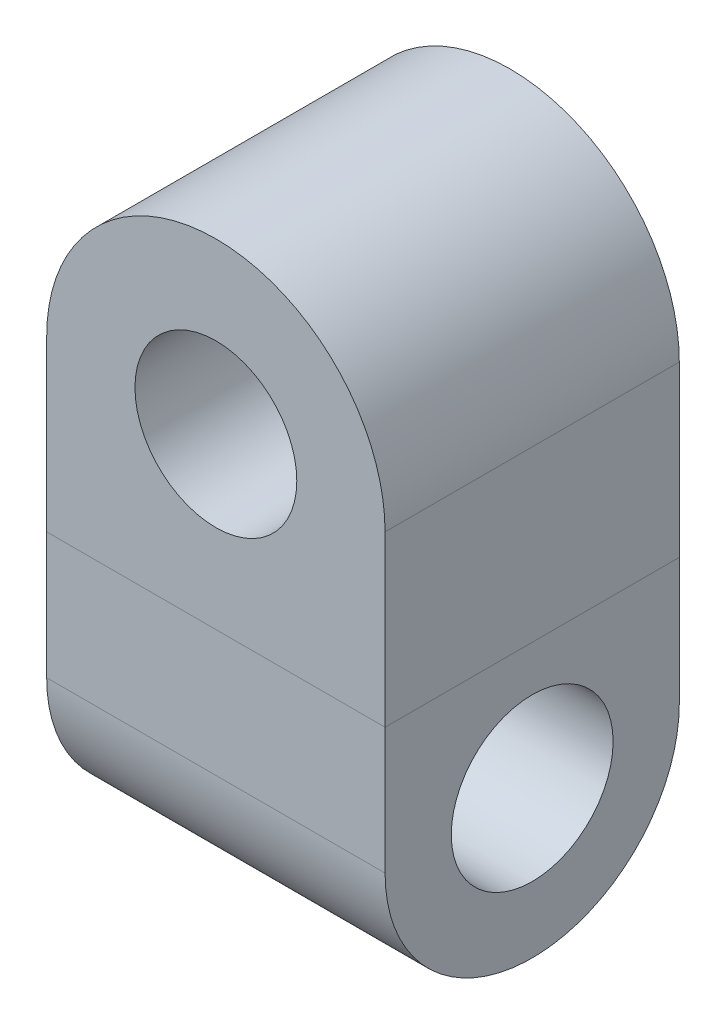
ISO-10303-21;
HEADER;
FILE_DESCRIPTION(('STEP AP214'),'2;1');
FILE_NAME('part.step','',(''),(''),'','','');
FILE_SCHEMA(('AUTOMOTIVE_DESIGN { 1 0 10303 214 1 1 1 1 }'));
ENDSEC;
DATA;
#1=APPLICATION_CONTEXT('core data for automotive mechanical design processes');
#2=APPLICATION_PROTOCOL_DEFINITION('international standard','automotive_design',2000,#1);
#3=PRODUCT_CONTEXT('',#1,'mechanical');
#4=PRODUCT('Part','Part','',(#3));
#5=PRODUCT_RELATED_PRODUCT_CATEGORY('part','',(#4));
#6=PRODUCT_DEFINITION_FORMATION('','',#4);
#7=PRODUCT_DEFINITION_CONTEXT('part definition',#1,'design');
#8=PRODUCT_DEFINITION('design','',#6,#7);
#9=PRODUCT_DEFINITION_SHAPE('','',#8);
#10=(LENGTH_UNIT() NAMED_UNIT(*) SI_UNIT(.MILLI.,.METRE.));
#11=(NAMED_UNIT(*) PLANE_ANGLE_UNIT() SI_UNIT($,.RADIAN.));
#12=(NAMED_UNIT(*) SI_UNIT($,.STERADIAN.) SOLID_ANGLE_UNIT());
#13=UNCERTAINTY_MEASURE_WITH_UNIT(LENGTH_MEASURE(1.E-05),#10,'distance_accuracy_value','');
#14=(GEOMETRIC_REPRESENTATION_CONTEXT(3) GLOBAL_UNCERTAINTY_ASSIGNED_CONTEXT((#13)) GLOBAL_UNIT_ASSIGNED_CONTEXT((#10,
#11,#12)) REPRESENTATION_CONTEXT('',''));
#15=CARTESIAN_POINT('',(0.,0.,0.));
#16=DIRECTION('',(0.,0.,1.));
#17=DIRECTION('',(1.,0.,0.));
#18=AXIS2_PLACEMENT_3D('',#15,#16,#17);
#19=CARTESIAN_POINT('',(-2.921,-5.10183762373373,2.54));
#20=DIRECTION('',(1.,0.,0.));
#21=DIRECTION('',(0.,1.,0.));
#22=AXIS2_PLACEMENT_3D('',#19,#20,#21);
#23=CYLINDRICAL_SURFACE('',#22,2.54);
#24=CARTESIAN_POINT('',(2.921,-5.10183762373373,2.54));
#25=DIRECTION('',(1.,0.,0.));
#26=DIRECTION('',(0.,0.,-1.));
#27=AXIS2_PLACEMENT_3D('',#24,#25,#26);
#28=CIRCLE('',#27,2.54);
#29=CARTESIAN_POINT('',(2.921,-5.10183762373373,5.08));
#30=VERTEX_POINT('',#29);
#31=CARTESIAN_POINT('',(2.921,-5.10183762373373,0.));
#32=VERTEX_POINT('',#31);
#33=EDGE_CURVE('E124',#30,#32,#28,.T.);
#34=ORIENTED_EDGE('',*,*,#33,.F.);
#35=DIRECTION('',(1.,0.,0.));
#36=VECTOR('',#35,1.);
#37=CARTESIAN_POINT('',(-2.921,-5.10183762373373,5.08));
#38=LINE('',#37,#36);
#39=CARTESIAN_POINT('',(-2.921,-5.10183762373373,5.08));
#40=VERTEX_POINT('',#39);
#41=EDGE_CURVE('E13',#40,#30,#38,.T.);
#42=ORIENTED_EDGE('',*,*,#41,.F.);
#43=CARTESIAN_POINT('',(-2.921,-5.10183762373373,2.54));
#44=DIRECTION('',(1.,0.,0.));
#45=DIRECTION('',(0.,0.,-1.));
#46=AXIS2_PLACEMENT_3D('',#43,#44,#45);
#47=CIRCLE('',#46,2.54);
#48=CARTESIAN_POINT('',(-2.921,-5.10183762373373,0.));
#49=VERTEX_POINT('',#48);
#50=EDGE_CURVE('E118',#40,#49,#47,.T.);
#51=ORIENTED_EDGE('',*,*,#50,.T.);
#52=DIRECTION('',(1.,0.,0.));
#53=VECTOR('',#52,1.);
#54=CARTESIAN_POINT('',(-2.921,-5.10183762373373,0.));
#55=LINE('',#54,#53);
#56=EDGE_CURVE('E61',#49,#32,#55,.T.);
#57=ORIENTED_EDGE('',*,*,#56,.T.);
#58=EDGE_LOOP('',(#34,#42,#51,#57));
#59=FACE_BOUND('',#58,.T.);
#60=ADVANCED_FACE('F58',(#59),#23,.T.);
#61=CARTESIAN_POINT('',(-2.921,-5.10183762373373,5.08));
#62=DIRECTION('',(0.,0.,-1.));
#63=DIRECTION('',(-1.,0.,0.));
#64=AXIS2_PLACEMENT_3D('',#61,#62,#63);
#65=PLANE('',#64);
#66=DIRECTION('',(0.,1.,0.));
#67=VECTOR('',#66,1.);
#68=CARTESIAN_POINT('',(2.921,-5.10183762373373,5.08));
#69=LINE('',#68,#67);
#70=CARTESIAN_POINT('',(2.921,-2.921,5.08));
#71=VERTEX_POINT('',#70);
#72=EDGE_CURVE('E91',#30,#71,#69,.T.);
#73=ORIENTED_EDGE('',*,*,#72,.T.);
#74=DIRECTION('',(1.,0.,0.));
#75=VECTOR('',#74,1.);
#76=CARTESIAN_POINT('',(-2.921,-2.921,5.08));
#77=LINE('',#76,#75);
#78=CARTESIAN_POINT('',(-2.921,-2.921,5.08));
#79=VERTEX_POINT('',#78);
#80=EDGE_CURVE('E67',#79,#71,#77,.T.);
#81=ORIENTED_EDGE('',*,*,#80,.F.);
#82=DIRECTION('',(0.,1.,0.));
#83=VECTOR('',#82,1.);
#84=CARTESIAN_POINT('',(-2.921,-5.10183762373373,5.08));
#85=LINE('',#84,#83);
#86=EDGE_CURVE('E108',#40,#79,#85,.T.);
#87=ORIENTED_EDGE('',*,*,#86,.F.);
#88=ORIENTED_EDGE('',*,*,#41,.T.);
#89=EDGE_LOOP('',(#73,#81,#87,#88));
#90=FACE_BOUND('',#89,.T.);
#91=ADVANCED_FACE('F135',(#90),#65,.F.);
#92=CARTESIAN_POINT('',(-2.921,-2.921,5.08));
#93=DIRECTION('',(0.,-1.,0.));
#94=DIRECTION('',(1.,0.,0.));
#95=AXIS2_PLACEMENT_3D('',#92,#93,#94);
#96=PLANE('',#95);
#97=DIRECTION('',(0.,0.,-1.));
#98=VECTOR('',#97,1.);
#99=CARTESIAN_POINT('',(2.921,-2.921,5.08));
#100=LINE('',#99,#98);
#101=CARTESIAN_POINT('',(2.921,-2.921,0.));
#102=VERTEX_POINT('',#101);
#103=EDGE_CURVE('E115',#71,#102,#100,.T.);
#104=ORIENTED_EDGE('',*,*,#103,.T.);
#105=DIRECTION('',(1.,0.,0.));
#106=VECTOR('',#105,1.);
#107=CARTESIAN_POINT('',(-2.921,-2.921,0.));
#108=LINE('',#107,#106);
#109=CARTESIAN_POINT('',(-2.921,-2.921,0.));
#110=VERTEX_POINT('',#109);
#111=EDGE_CURVE('E112',#110,#102,#108,.T.);
#112=ORIENTED_EDGE('',*,*,#111,.F.);
#113=DIRECTION('',(0.,0.,-1.));
#114=VECTOR('',#113,1.);
#115=CARTESIAN_POINT('',(-2.921,-2.921,5.08));
#116=LINE('',#115,#114);
#117=EDGE_CURVE('E103',#79,#110,#116,.T.);
#118=ORIENTED_EDGE('',*,*,#117,.F.);
#119=ORIENTED_EDGE('',*,*,#80,.T.);
#120=EDGE_LOOP('',(#104,#112,#118,#119));
#121=FACE_BOUND('',#120,.T.);
#122=ADVANCED_FACE('F113',(#121),#96,.F.);
#123=CARTESIAN_POINT('',(-2.921,-5.10183762373373,0.));
#124=DIRECTION('',(0.,0.,-1.));
#125=DIRECTION('',(-1.,0.,0.));
#126=AXIS2_PLACEMENT_3D('',#123,#124,#125);
#127=PLANE('',#126);
#128=DIRECTION('',(0.,1.,0.));
#129=VECTOR('',#128,1.);
#130=CARTESIAN_POINT('',(2.921,-5.10183762373373,0.));
#131=LINE('',#130,#129);
#132=EDGE_CURVE('E127',#32,#102,#131,.T.);
#133=ORIENTED_EDGE('',*,*,#132,.F.);
#134=ORIENTED_EDGE('',*,*,#56,.F.);
#135=DIRECTION('',(0.,1.,0.));
#136=VECTOR('',#135,1.);
#137=CARTESIAN_POINT('',(-2.921,-5.10183762373373,0.));
#138=LINE('',#137,#136);
#139=EDGE_CURVE('E107',#49,#110,#138,.T.);
#140=ORIENTED_EDGE('',*,*,#139,.T.);
#141=ORIENTED_EDGE('',*,*,#111,.T.);
#142=EDGE_LOOP('',(#133,#134,#140,#141));
#143=FACE_BOUND('',#142,.T.);
#144=ADVANCED_FACE('F117',(#143),#127,.T.);
#145=CARTESIAN_POINT('',(-2.921,-5.10183762373373,2.54));
#146=DIRECTION('',(1.,0.,0.));
#147=DIRECTION('',(0.,0.,-1.));
#148=AXIS2_PLACEMENT_3D('',#145,#146,#147);
#149=PLANE('',#148);
#150=CARTESIAN_POINT('',(-2.921,-5.10183762373373,2.54));
#151=DIRECTION('',(1.,0.,0.));
#152=DIRECTION('',(0.,0.,-1.));
#153=AXIS2_PLACEMENT_3D('',#150,#151,#152);
#154=CIRCLE('',#153,1.397);
#155=CARTESIAN_POINT('',(-2.921,-5.10183762373373,1.143));
#156=VERTEX_POINT('',#155);
#157=EDGE_CURVE('E128',#156,#156,#154,.T.);
#158=ORIENTED_EDGE('',*,*,#157,.T.);
#159=EDGE_LOOP('',(#158));
#160=FACE_BOUND('',#159,.T.);
#161=ORIENTED_EDGE('',*,*,#50,.F.);
#162=ORIENTED_EDGE('',*,*,#86,.T.);
#163=ORIENTED_EDGE('',*,*,#117,.T.);
#164=ORIENTED_EDGE('',*,*,#139,.F.);
#165=EDGE_LOOP('',(#161,#162,#163,#164));
#166=FACE_BOUND('',#165,.T.);
#167=ADVANCED_FACE('F106',(#160,#166),#149,.F.);
#168=CARTESIAN_POINT('',(2.921,-5.10183762373373,2.54));
#169=DIRECTION('',(1.,0.,0.));
#170=DIRECTION('',(0.,0.,-1.));
#171=AXIS2_PLACEMENT_3D('',#168,#169,#170);
#172=PLANE('',#171);
#173=CARTESIAN_POINT('',(2.921,-5.10183762373373,2.54));
#174=DIRECTION('',(1.,0.,0.));
#175=DIRECTION('',(0.,0.,-1.));
#176=AXIS2_PLACEMENT_3D('',#173,#174,#175);
#177=CIRCLE('',#176,1.397);
#178=CARTESIAN_POINT('',(2.921,-5.10183762373373,1.143));
#179=VERTEX_POINT('',#178);
#180=EDGE_CURVE('E166',#179,#179,#177,.T.);
#181=ORIENTED_EDGE('',*,*,#180,.F.);
#182=EDGE_LOOP('',(#181));
#183=FACE_BOUND('',#182,.T.);
#184=ORIENTED_EDGE('',*,*,#33,.T.);
#185=ORIENTED_EDGE('',*,*,#132,.T.);
#186=ORIENTED_EDGE('',*,*,#103,.F.);
#187=ORIENTED_EDGE('',*,*,#72,.F.);
#188=EDGE_LOOP('',(#184,#185,#186,#187));
#189=FACE_BOUND('',#188,.T.);
#190=ADVANCED_FACE('F133',(#183,#189),#172,.T.);
#191=CARTESIAN_POINT('',(-2.921,-5.10183762373373,2.54));
#192=DIRECTION('',(1.,0.,0.));
#193=DIRECTION('',(0.,1.,0.));
#194=AXIS2_PLACEMENT_3D('',#191,#192,#193);
#195=CYLINDRICAL_SURFACE('',#194,1.397);
#196=ORIENTED_EDGE('',*,*,#157,.F.);
#197=EDGE_LOOP('',(#196));
#198=FACE_BOUND('',#197,.T.);
#199=ORIENTED_EDGE('',*,*,#180,.T.);
#200=EDGE_LOOP('',(#199));
#201=FACE_BOUND('',#200,.T.);
#202=ADVANCED_FACE('F154',(#198,#201),#195,.F.);
#203=CLOSED_SHELL('',(#60,#91,#122,#144,#167,#190,#202));
#204=MANIFOLD_SOLID_BREP('B2',#203);
#205=CARTESIAN_POINT('',(0.,0.,5.08));
#206=DIRECTION('',(0.,0.,1.));
#207=DIRECTION('',(1.,0.,0.));
#208=AXIS2_PLACEMENT_3D('',#205,#206,#207);
#209=PLANE('',#208);
#210=CARTESIAN_POINT('',(0.,0.,5.08));
#211=DIRECTION('',(0.,0.,1.));
#212=DIRECTION('',(1.,0.,0.));
#213=AXIS2_PLACEMENT_3D('',#210,#211,#212);
#214=CIRCLE('',#213,2.921);
#215=CARTESIAN_POINT('',(2.921,0.,5.08));
#216=VERTEX_POINT('',#215);
#217=CARTESIAN_POINT('',(-2.921,0.,5.08));
#218=VERTEX_POINT('',#217);
#219=EDGE_CURVE('E255',#216,#218,#214,.T.);
#220=ORIENTED_EDGE('',*,*,#219,.T.);
#221=DIRECTION('',(0.,-1.,0.));
#222=VECTOR('',#221,1.);
#223=CARTESIAN_POINT('',(-2.921,0.,5.08));
#224=LINE('',#223,#222);
#225=CARTESIAN_POINT('',(-2.921,-2.921,5.08));
#226=VERTEX_POINT('',#225);
#227=EDGE_CURVE('E250',#218,#226,#224,.T.);
#228=ORIENTED_EDGE('',*,*,#227,.T.);
#229=DIRECTION('',(1.,0.,0.));
#230=VECTOR('',#229,1.);
#231=CARTESIAN_POINT('',(2.921,-2.921,5.08));
#232=LINE('',#231,#230);
#233=CARTESIAN_POINT('',(2.921,-2.921,5.08));
#234=VERTEX_POINT('',#233);
#235=EDGE_CURVE('E253',#226,#234,#232,.T.);
#236=ORIENTED_EDGE('',*,*,#235,.T.);
#237=DIRECTION('',(0.,1.,0.));
#238=VECTOR('',#237,1.);
#239=CARTESIAN_POINT('',(2.921,0.,5.08));
#240=LINE('',#239,#238);
#241=EDGE_CURVE('E220',#234,#216,#240,.T.);
#242=ORIENTED_EDGE('',*,*,#241,.T.);
#243=EDGE_LOOP('',(#220,#228,#236,#242));
#244=FACE_BOUND('',#243,.T.);
#245=CARTESIAN_POINT('',(0.,0.,5.08));
#246=DIRECTION('',(0.,0.,1.));
#247=DIRECTION('',(1.,0.,0.));
#248=AXIS2_PLACEMENT_3D('',#245,#246,#247);
#249=CIRCLE('',#248,1.397);
#250=CARTESIAN_POINT('',(1.397,0.,5.08));
#251=VERTEX_POINT('',#250);
#252=EDGE_CURVE('E270',#251,#251,#249,.T.);
#253=ORIENTED_EDGE('',*,*,#252,.F.);
#254=EDGE_LOOP('',(#253));
#255=FACE_BOUND('',#254,.T.);
#256=ADVANCED_FACE('F203',(#244,#255),#209,.T.);
#257=CARTESIAN_POINT('',(0.,0.,0.));
#258=DIRECTION('',(0.,0.,1.));
#259=DIRECTION('',(1.,0.,0.));
#260=AXIS2_PLACEMENT_3D('',#257,#258,#259);
#261=PLANE('',#260);
#262=CARTESIAN_POINT('',(0.,0.,0.));
#263=DIRECTION('',(0.,0.,1.));
#264=DIRECTION('',(1.,0.,0.));
#265=AXIS2_PLACEMENT_3D('',#262,#263,#264);
#266=CIRCLE('',#265,2.921);
#267=CARTESIAN_POINT('',(2.921,0.,0.));
#268=VERTEX_POINT('',#267);
#269=CARTESIAN_POINT('',(-2.921,0.,0.));
#270=VERTEX_POINT('',#269);
#271=EDGE_CURVE('E267',#268,#270,#266,.T.);
#272=ORIENTED_EDGE('',*,*,#271,.F.);
#273=DIRECTION('',(0.,1.,0.));
#274=VECTOR('',#273,1.);
#275=CARTESIAN_POINT('',(2.921,0.,0.));
#276=LINE('',#275,#274);
#277=CARTESIAN_POINT('',(2.921,-2.921,0.));
#278=VERTEX_POINT('',#277);
#279=EDGE_CURVE('E243',#278,#268,#276,.T.);
#280=ORIENTED_EDGE('',*,*,#279,.F.);
#281=DIRECTION('',(1.,0.,0.));
#282=VECTOR('',#281,1.);
#283=CARTESIAN_POINT('',(2.921,-2.921,0.));
#284=LINE('',#283,#282);
#285=CARTESIAN_POINT('',(-2.921,-2.921,0.));
#286=VERTEX_POINT('',#285);
#287=EDGE_CURVE('E237',#286,#278,#284,.T.);
#288=ORIENTED_EDGE('',*,*,#287,.F.);
#289=DIRECTION('',(0.,-1.,0.));
#290=VECTOR('',#289,1.);
#291=CARTESIAN_POINT('',(-2.921,0.,0.));
#292=LINE('',#291,#290);
#293=EDGE_CURVE('E259',#270,#286,#292,.T.);
#294=ORIENTED_EDGE('',*,*,#293,.F.);
#295=EDGE_LOOP('',(#272,#280,#288,#294));
#296=FACE_BOUND('',#295,.T.);
#297=CARTESIAN_POINT('',(0.,0.,0.));
#298=DIRECTION('',(0.,0.,1.));
#299=DIRECTION('',(1.,0.,0.));
#300=AXIS2_PLACEMENT_3D('',#297,#298,#299);
#301=CIRCLE('',#300,1.397);
#302=CARTESIAN_POINT('',(1.397,0.,0.));
#303=VERTEX_POINT('',#302);
#304=EDGE_CURVE('E282',#303,#303,#301,.T.);
#305=ORIENTED_EDGE('',*,*,#304,.T.);
#306=EDGE_LOOP('',(#305));
#307=FACE_BOUND('',#306,.T.);
#308=ADVANCED_FACE('F278',(#296,#307),#261,.F.);
#309=CARTESIAN_POINT('',(0.,0.,5.08));
#310=DIRECTION('',(0.,0.,-1.));
#311=DIRECTION('',(-1.,0.,0.));
#312=AXIS2_PLACEMENT_3D('',#309,#310,#311);
#313=CYLINDRICAL_SURFACE('',#312,2.921);
#314=ORIENTED_EDGE('',*,*,#271,.T.);
#315=DIRECTION('',(0.,0.,-1.));
#316=VECTOR('',#315,1.);
#317=CARTESIAN_POINT('',(-2.921,0.,5.08));
#318=LINE('',#317,#316);
#319=EDGE_CURVE('E56',#218,#270,#318,.T.);
#320=ORIENTED_EDGE('',*,*,#319,.F.);
#321=ORIENTED_EDGE('',*,*,#219,.F.);
#322=DIRECTION('',(0.,0.,-1.));
#323=VECTOR('',#322,1.);
#324=CARTESIAN_POINT('',(2.921,0.,5.08));
#325=LINE('',#324,#323);
#326=EDGE_CURVE('E263',#216,#268,#325,.T.);
#327=ORIENTED_EDGE('',*,*,#326,.T.);
#328=EDGE_LOOP('',(#314,#320,#321,#327));
#329=FACE_BOUND('',#328,.T.);
#330=ADVANCED_FACE('F205',(#329),#313,.T.);
#331=CARTESIAN_POINT('',(-2.921,0.,5.08));
#332=DIRECTION('',(1.,0.,0.));
#333=DIRECTION('',(0.,1.,0.));
#334=AXIS2_PLACEMENT_3D('',#331,#332,#333);
#335=PLANE('',#334);
#336=ORIENTED_EDGE('',*,*,#293,.T.);
#337=DIRECTION('',(0.,0.,-1.));
#338=VECTOR('',#337,1.);
#339=CARTESIAN_POINT('',(-2.921,-2.921,5.08));
#340=LINE('',#339,#338);
#341=EDGE_CURVE('E212',#226,#286,#340,.T.);
#342=ORIENTED_EDGE('',*,*,#341,.F.);
#343=ORIENTED_EDGE('',*,*,#227,.F.);
#344=ORIENTED_EDGE('',*,*,#319,.T.);
#345=EDGE_LOOP('',(#336,#342,#343,#344));
#346=FACE_BOUND('',#345,.T.);
#347=ADVANCED_FACE('F258',(#346),#335,.F.);
#348=CARTESIAN_POINT('',(2.921,-2.921,5.08));
#349=DIRECTION('',(0.,1.,0.));
#350=DIRECTION('',(0.,0.,1.));
#351=AXIS2_PLACEMENT_3D('',#348,#349,#350);
#352=PLANE('',#351);
#353=ORIENTED_EDGE('',*,*,#287,.T.);
#354=DIRECTION('',(0.,0.,-1.));
#355=VECTOR('',#354,1.);
#356=CARTESIAN_POINT('',(2.921,-2.921,5.08));
#357=LINE('',#356,#355);
#358=EDGE_CURVE('E260',#234,#278,#357,.T.);
#359=ORIENTED_EDGE('',*,*,#358,.F.);
#360=ORIENTED_EDGE('',*,*,#235,.F.);
#361=ORIENTED_EDGE('',*,*,#341,.T.);
#362=EDGE_LOOP('',(#353,#359,#360,#361));
#363=FACE_BOUND('',#362,.T.);
#364=ADVANCED_FACE('F261',(#363),#352,.F.);
#365=CARTESIAN_POINT('',(2.921,0.,5.08));
#366=DIRECTION('',(-1.,0.,0.));
#367=DIRECTION('',(0.,-1.,0.));
#368=AXIS2_PLACEMENT_3D('',#365,#366,#367);
#369=PLANE('',#368);
#370=ORIENTED_EDGE('',*,*,#279,.T.);
#371=ORIENTED_EDGE('',*,*,#326,.F.);
#372=ORIENTED_EDGE('',*,*,#241,.F.);
#373=ORIENTED_EDGE('',*,*,#358,.T.);
#374=EDGE_LOOP('',(#370,#371,#372,#373));
#375=FACE_BOUND('',#374,.T.);
#376=ADVANCED_FACE('F275',(#375),#369,.F.);
#377=CARTESIAN_POINT('',(0.,0.,5.08));
#378=DIRECTION('',(0.,0.,-1.));
#379=DIRECTION('',(-1.,0.,0.));
#380=AXIS2_PLACEMENT_3D('',#377,#378,#379);
#381=CYLINDRICAL_SURFACE('',#380,1.397);
#382=ORIENTED_EDGE('',*,*,#252,.T.);
#383=EDGE_LOOP('',(#382));
#384=FACE_BOUND('',#383,.T.);
#385=ORIENTED_EDGE('',*,*,#304,.F.);
#386=EDGE_LOOP('',(#385));
#387=FACE_BOUND('',#386,.T.);
#388=ADVANCED_FACE('F288',(#384,#387),#381,.F.);
#389=CLOSED_SHELL('',(#256,#308,#330,#347,#364,#376,#388));
#390=MANIFOLD_SOLID_BREP('B7',#389);
#391=ADVANCED_BREP_SHAPE_REPRESENTATION('',(#18,#204,#390),#14);
#392=SHAPE_DEFINITION_REPRESENTATION(#9,#391);
ENDSEC;
END-ISO-10303-21;
